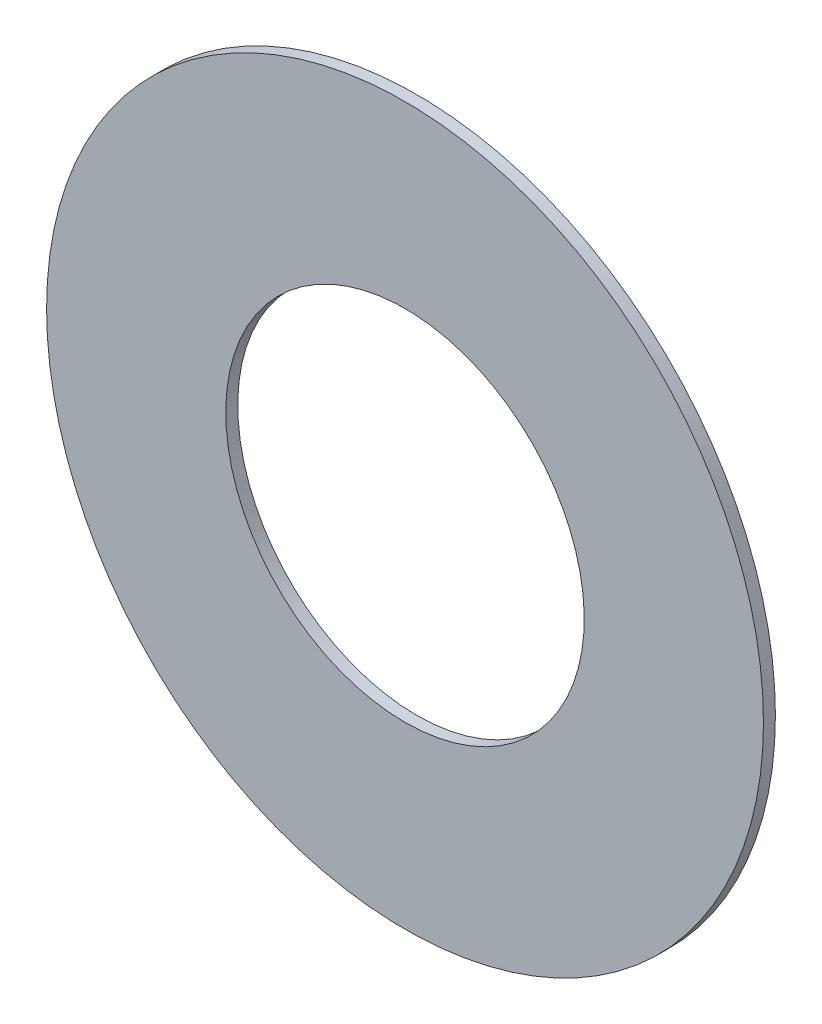
ISO-10303-21;
HEADER;
FILE_DESCRIPTION(('STEP AP214'),'2;1');
FILE_NAME('part.step','',(''),(''),'','','');
FILE_SCHEMA(('AUTOMOTIVE_DESIGN { 1 0 10303 214 1 1 1 1 }'));
ENDSEC;
DATA;
#1=APPLICATION_CONTEXT('core data for automotive mechanical design processes');
#2=APPLICATION_PROTOCOL_DEFINITION('international standard','automotive_design',2000,#1);
#3=PRODUCT_CONTEXT('',#1,'mechanical');
#4=PRODUCT('Part','Part','',(#3));
#5=PRODUCT_RELATED_PRODUCT_CATEGORY('part','',(#4));
#6=PRODUCT_DEFINITION_FORMATION('','',#4);
#7=PRODUCT_DEFINITION_CONTEXT('part definition',#1,'design');
#8=PRODUCT_DEFINITION('design','',#6,#7);
#9=PRODUCT_DEFINITION_SHAPE('','',#8);
#10=(LENGTH_UNIT() NAMED_UNIT(*) SI_UNIT(.MILLI.,.METRE.));
#11=(NAMED_UNIT(*) PLANE_ANGLE_UNIT() SI_UNIT($,.RADIAN.));
#12=(NAMED_UNIT(*) SI_UNIT($,.STERADIAN.) SOLID_ANGLE_UNIT());
#13=UNCERTAINTY_MEASURE_WITH_UNIT(LENGTH_MEASURE(1.E-05),#10,'distance_accuracy_value','');
#14=(GEOMETRIC_REPRESENTATION_CONTEXT(3) GLOBAL_UNCERTAINTY_ASSIGNED_CONTEXT((#13)) GLOBAL_UNIT_ASSIGNED_CONTEXT((#10,
#11,#12)) REPRESENTATION_CONTEXT('',''));
#15=CARTESIAN_POINT('',(0.,0.,0.));
#16=DIRECTION('',(0.,0.,1.));
#17=DIRECTION('',(1.,0.,0.));
#18=AXIS2_PLACEMENT_3D('',#15,#16,#17);
#19=CARTESIAN_POINT('',(139.452,-111.734,-0.045));
#20=DIRECTION('',(0.,0.,-1.));
#21=DIRECTION('',(0.,-1.,0.));
#22=AXIS2_PLACEMENT_3D('',#19,#20,#21);
#23=CYLINDRICAL_SURFACE('',#22,0.525);
#24=CARTESIAN_POINT('',(139.452,-111.734,1.67));
#25=DIRECTION('',(0.,0.,-1.));
#26=DIRECTION('',(0.,-1.,0.));
#27=AXIS2_PLACEMENT_3D('',#24,#25,#26);
#28=CIRCLE('',#27,0.525);
#29=CARTESIAN_POINT('',(139.452,-112.259,1.67));
#30=VERTEX_POINT('',#29);
#31=EDGE_CURVE('E25',#30,#30,#28,.T.);
#32=ORIENTED_EDGE('',*,*,#31,.T.);
#33=DIRECTION('',(0.,0.,1.));
#34=VECTOR('',#33,1.);
#35=CARTESIAN_POINT('',(139.452,-112.259,-0.045));
#36=LINE('',#35,#34);
#37=CARTESIAN_POINT('',(139.452,-112.259,1.705));
#38=VERTEX_POINT('',#37);
#39=EDGE_CURVE('E11',#30,#38,#36,.T.);
#40=ORIENTED_EDGE('',*,*,#39,.T.);
#41=CARTESIAN_POINT('',(139.452,-111.734,1.705));
#42=DIRECTION('',(0.,0.,-1.));
#43=DIRECTION('',(0.,-1.,0.));
#44=AXIS2_PLACEMENT_3D('',#41,#42,#43);
#45=CIRCLE('',#44,0.525);
#46=EDGE_CURVE('E67',#38,#38,#45,.T.);
#47=ORIENTED_EDGE('',*,*,#46,.F.);
#48=ORIENTED_EDGE('',*,*,#39,.F.);
#49=EDGE_LOOP('',(#32,#40,#47,#48));
#50=FACE_BOUND('',#49,.T.);
#51=ADVANCED_FACE('F17',(#50),#23,.F.);
#52=CARTESIAN_POINT('',(139.452,-111.734,1.67));
#53=DIRECTION('',(0.,0.,1.));
#54=DIRECTION('',(1.,0.,0.));
#55=AXIS2_PLACEMENT_3D('',#52,#53,#54);
#56=PLANE('',#55);
#57=ORIENTED_EDGE('',*,*,#31,.F.);
#58=EDGE_LOOP('',(#57));
#59=FACE_BOUND('',#58,.T.);
#60=CARTESIAN_POINT('',(139.452,-111.734,1.67));
#61=DIRECTION('',(0.,0.,1.));
#62=DIRECTION('',(1.,0.,0.));
#63=AXIS2_PLACEMENT_3D('',#60,#61,#62);
#64=CIRCLE('',#63,1.05);
#65=CARTESIAN_POINT('',(140.502,-111.734,1.67));
#66=VERTEX_POINT('',#65);
#67=EDGE_CURVE('E56',#66,#66,#64,.T.);
#68=ORIENTED_EDGE('',*,*,#67,.F.);
#69=EDGE_LOOP('',(#68));
#70=FACE_BOUND('',#69,.T.);
#71=ADVANCED_FACE('F79',(#59,#70),#56,.F.);
#72=CARTESIAN_POINT('',(139.452,-111.734,1.705));
#73=DIRECTION('',(0.,0.,1.));
#74=DIRECTION('',(1.,0.,0.));
#75=AXIS2_PLACEMENT_3D('',#72,#73,#74);
#76=PLANE('',#75);
#77=ORIENTED_EDGE('',*,*,#46,.T.);
#78=EDGE_LOOP('',(#77));
#79=FACE_BOUND('',#78,.T.);
#80=CARTESIAN_POINT('',(139.452,-111.734,1.705));
#81=DIRECTION('',(0.,0.,1.));
#82=DIRECTION('',(1.,0.,0.));
#83=AXIS2_PLACEMENT_3D('',#80,#81,#82);
#84=CIRCLE('',#83,1.05);
#85=CARTESIAN_POINT('',(140.502,-111.734,1.705));
#86=VERTEX_POINT('',#85);
#87=EDGE_CURVE('E54',#86,#86,#84,.T.);
#88=ORIENTED_EDGE('',*,*,#87,.T.);
#89=EDGE_LOOP('',(#88));
#90=FACE_BOUND('',#89,.T.);
#91=ADVANCED_FACE('F60',(#79,#90),#76,.T.);
#92=CARTESIAN_POINT('',(139.452,-111.734,1.67));
#93=DIRECTION('',(0.,0.,1.));
#94=DIRECTION('',(1.,0.,0.));
#95=AXIS2_PLACEMENT_3D('',#92,#93,#94);
#96=CYLINDRICAL_SURFACE('',#95,1.05);
#97=ORIENTED_EDGE('',*,*,#87,.F.);
#98=DIRECTION('',(0.,0.,1.));
#99=VECTOR('',#98,1.);
#100=CARTESIAN_POINT('',(140.502,-111.734,1.67));
#101=LINE('',#100,#99);
#102=EDGE_CURVE('E51',#66,#86,#101,.T.);
#103=ORIENTED_EDGE('',*,*,#102,.F.);
#104=ORIENTED_EDGE('',*,*,#67,.T.);
#105=ORIENTED_EDGE('',*,*,#102,.T.);
#106=EDGE_LOOP('',(#97,#103,#104,#105));
#107=FACE_BOUND('',#106,.T.);
#108=ADVANCED_FACE('F53',(#107),#96,.T.);
#109=CLOSED_SHELL('',(#51,#71,#91,#108));
#110=MANIFOLD_SOLID_BREP('B1',#109);
#111=ADVANCED_BREP_SHAPE_REPRESENTATION('',(#18,#110),#14);
#112=SHAPE_DEFINITION_REPRESENTATION(#9,#111);
ENDSEC;
END-ISO-10303-21;
